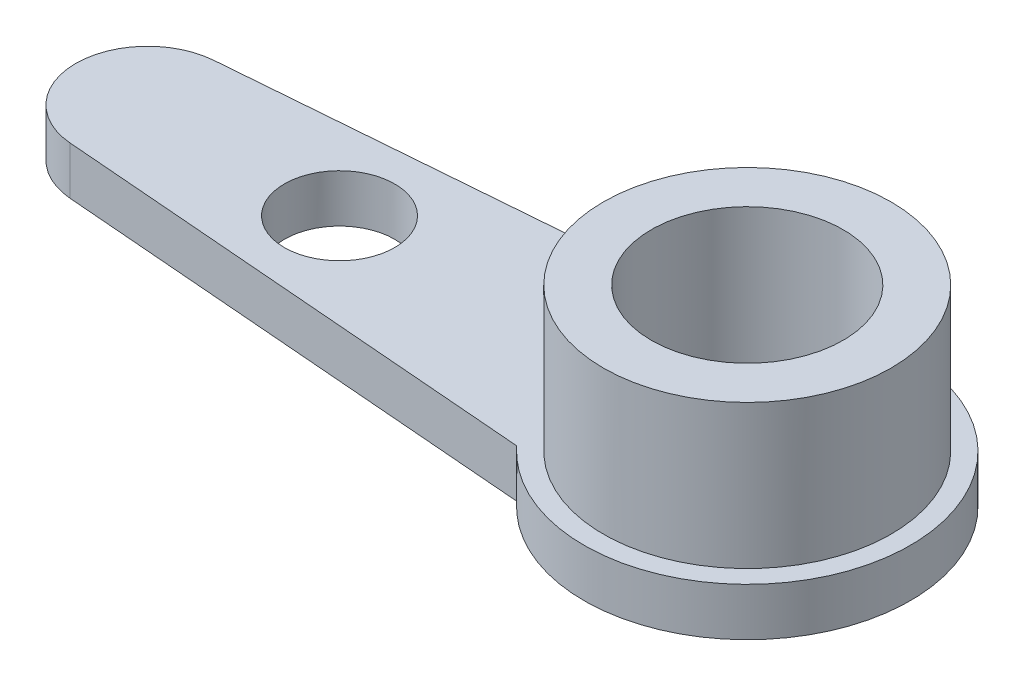
ISO-10303-21;
HEADER;
FILE_DESCRIPTION(('STEP AP214'),'2;1');
FILE_NAME('part.step','',(''),(''),'','','');
FILE_SCHEMA(('AUTOMOTIVE_DESIGN { 1 0 10303 214 1 1 1 1 }'));
ENDSEC;
DATA;
#1=APPLICATION_CONTEXT('core data for automotive mechanical design processes');
#2=APPLICATION_PROTOCOL_DEFINITION('international standard','automotive_design',2000,#1);
#3=PRODUCT_CONTEXT('',#1,'mechanical');
#4=PRODUCT('Part','Part','',(#3));
#5=PRODUCT_RELATED_PRODUCT_CATEGORY('part','',(#4));
#6=PRODUCT_DEFINITION_FORMATION('','',#4);
#7=PRODUCT_DEFINITION_CONTEXT('part definition',#1,'design');
#8=PRODUCT_DEFINITION('design','',#6,#7);
#9=PRODUCT_DEFINITION_SHAPE('','',#8);
#10=(LENGTH_UNIT() NAMED_UNIT(*) SI_UNIT(.MILLI.,.METRE.));
#11=(NAMED_UNIT(*) PLANE_ANGLE_UNIT() SI_UNIT($,.RADIAN.));
#12=(NAMED_UNIT(*) SI_UNIT($,.STERADIAN.) SOLID_ANGLE_UNIT());
#13=UNCERTAINTY_MEASURE_WITH_UNIT(LENGTH_MEASURE(1.E-05),#10,'distance_accuracy_value','');
#14=(GEOMETRIC_REPRESENTATION_CONTEXT(3) GLOBAL_UNCERTAINTY_ASSIGNED_CONTEXT((#13)) GLOBAL_UNIT_ASSIGNED_CONTEXT((#10,
#11,#12)) REPRESENTATION_CONTEXT('',''));
#15=CARTESIAN_POINT('',(0.,0.,0.));
#16=DIRECTION('',(0.,0.,1.));
#17=DIRECTION('',(1.,0.,0.));
#18=AXIS2_PLACEMENT_3D('',#15,#16,#17);
#19=CARTESIAN_POINT('',(12.5,1.,0.));
#20=DIRECTION('',(0.,-1.,0.));
#21=DIRECTION('',(0.,0.,-1.));
#22=AXIS2_PLACEMENT_3D('',#19,#20,#21);
#23=PLANE('',#22);
#24=DIRECTION('',(0.996794863550169,0.,0.08));
#25=VECTOR('',#24,1.);
#26=CARTESIAN_POINT('',(-12.62,1.,1.49519229532525));
#27=LINE('',#26,#25);
#28=CARTESIAN_POINT('',(-12.62,1.,1.49519229532525));
#29=VERTEX_POINT('',#28);
#30=CARTESIAN_POINT('',(-2.5,1.,2.30739551747724));
#31=VERTEX_POINT('',#30);
#32=EDGE_CURVE('E93',#29,#31,#27,.T.);
#33=ORIENTED_EDGE('',*,*,#32,.T.);
#34=CARTESIAN_POINT('',(0.,0.999999999999999,0.));
#35=DIRECTION('',(0.,-1.,0.));
#36=DIRECTION('',(0.,0.,-1.));
#37=AXIS2_PLACEMENT_3D('',#34,#35,#36);
#38=CIRCLE('',#37,3.40206908719886);
#39=CARTESIAN_POINT('',(-2.5,0.999999999999999,-2.30739551747724));
#40=VERTEX_POINT('',#39);
#41=EDGE_CURVE('E53',#31,#40,#38,.F.);
#42=ORIENTED_EDGE('',*,*,#41,.T.);
#43=DIRECTION('',(-0.996794863550169,0.,0.08));
#44=VECTOR('',#43,1.);
#45=CARTESIAN_POINT('',(-12.62,1.,-1.49519229532525));
#46=LINE('',#45,#44);
#47=CARTESIAN_POINT('',(-12.62,1.,-1.49519229532525));
#48=VERTEX_POINT('',#47);
#49=EDGE_CURVE('E78',#40,#48,#46,.T.);
#50=ORIENTED_EDGE('',*,*,#49,.T.);
#51=CARTESIAN_POINT('',(-12.5,1.,0.));
#52=DIRECTION('',(0.,1.,0.));
#53=DIRECTION('',(0.,0.,1.));
#54=AXIS2_PLACEMENT_3D('',#51,#52,#53);
#55=CIRCLE('',#54,1.5);
#56=EDGE_CURVE('E81',#48,#29,#55,.T.);
#57=ORIENTED_EDGE('',*,*,#56,.T.);
#58=EDGE_LOOP('',(#33,#42,#50,#57));
#59=FACE_BOUND('',#58,.T.);
#60=CARTESIAN_POINT('',(-8.5,1.,0.));
#61=DIRECTION('',(0.,1.,0.));
#62=DIRECTION('',(0.,0.,1.));
#63=AXIS2_PLACEMENT_3D('',#60,#61,#62);
#64=CIRCLE('',#63,1.15);
#65=CARTESIAN_POINT('',(-8.5,1.,1.15));
#66=VERTEX_POINT('',#65);
#67=EDGE_CURVE('E109',#66,#66,#64,.T.);
#68=ORIENTED_EDGE('',*,*,#67,.F.);
#69=EDGE_LOOP('',(#68));
#70=FACE_BOUND('',#69,.T.);
#71=CARTESIAN_POINT('',(0.,1.,0.));
#72=DIRECTION('',(0.,-1.,0.));
#73=DIRECTION('',(0.,0.,-1.));
#74=AXIS2_PLACEMENT_3D('',#71,#72,#73);
#75=CIRCLE('',#74,3.);
#76=CARTESIAN_POINT('',(0.,1.,-3.));
#77=VERTEX_POINT('',#76);
#78=EDGE_CURVE('E11',#77,#77,#75,.F.);
#79=ORIENTED_EDGE('',*,*,#78,.F.);
#80=EDGE_LOOP('',(#79));
#81=FACE_BOUND('',#80,.T.);
#82=ADVANCED_FACE('F36',(#59,#70,#81),#23,.F.);
#83=CARTESIAN_POINT('',(12.5,0.,0.));
#84=DIRECTION('',(0.,-1.,0.));
#85=DIRECTION('',(0.,0.,-1.));
#86=AXIS2_PLACEMENT_3D('',#83,#84,#85);
#87=PLANE('',#86);
#88=CARTESIAN_POINT('',(0.,0.,0.));
#89=DIRECTION('',(0.,1.,0.));
#90=DIRECTION('',(0.,0.,-1.));
#91=AXIS2_PLACEMENT_3D('',#88,#89,#90);
#92=CIRCLE('',#91,3.40206908719886);
#93=CARTESIAN_POINT('',(-2.5,0.,2.30739551747724));
#94=VERTEX_POINT('',#93);
#95=CARTESIAN_POINT('',(-2.5,0.,-2.30739551747724));
#96=VERTEX_POINT('',#95);
#97=EDGE_CURVE('E125',#94,#96,#92,.T.);
#98=ORIENTED_EDGE('',*,*,#97,.F.);
#99=DIRECTION('',(0.996794863550169,0.,0.08));
#100=VECTOR('',#99,1.);
#101=CARTESIAN_POINT('',(-12.62,0.,1.49519229532525));
#102=LINE('',#101,#100);
#103=CARTESIAN_POINT('',(-12.62,0.,1.49519229532525));
#104=VERTEX_POINT('',#103);
#105=EDGE_CURVE('E83',#104,#94,#102,.T.);
#106=ORIENTED_EDGE('',*,*,#105,.F.);
#107=CARTESIAN_POINT('',(-12.5,0.,0.));
#108=DIRECTION('',(0.,1.,0.));
#109=DIRECTION('',(0.,0.,1.));
#110=AXIS2_PLACEMENT_3D('',#107,#108,#109);
#111=CIRCLE('',#110,1.5);
#112=CARTESIAN_POINT('',(-12.62,0.,-1.49519229532525));
#113=VERTEX_POINT('',#112);
#114=EDGE_CURVE('E100',#113,#104,#111,.T.);
#115=ORIENTED_EDGE('',*,*,#114,.F.);
#116=DIRECTION('',(-0.996794863550169,0.,0.08));
#117=VECTOR('',#116,1.);
#118=CARTESIAN_POINT('',(-12.62,0.,-1.49519229532525));
#119=LINE('',#118,#117);
#120=EDGE_CURVE('E66',#96,#113,#119,.T.);
#121=ORIENTED_EDGE('',*,*,#120,.F.);
#122=EDGE_LOOP('',(#98,#106,#115,#121));
#123=FACE_BOUND('',#122,.T.);
#124=CARTESIAN_POINT('',(-8.5,0.,0.));
#125=DIRECTION('',(0.,-1.,0.));
#126=DIRECTION('',(0.,0.,-1.));
#127=AXIS2_PLACEMENT_3D('',#124,#125,#126);
#128=CIRCLE('',#127,1.15);
#129=CARTESIAN_POINT('',(-8.5,0.,-1.15));
#130=VERTEX_POINT('',#129);
#131=EDGE_CURVE('E107',#130,#130,#128,.T.);
#132=ORIENTED_EDGE('',*,*,#131,.F.);
#133=EDGE_LOOP('',(#132));
#134=FACE_BOUND('',#133,.T.);
#135=CARTESIAN_POINT('',(0.,0.,0.));
#136=DIRECTION('',(0.,1.,0.));
#137=DIRECTION('',(0.,0.,1.));
#138=AXIS2_PLACEMENT_3D('',#135,#136,#137);
#139=CIRCLE('',#138,2.);
#140=CARTESIAN_POINT('',(0.,0.,2.));
#141=VERTEX_POINT('',#140);
#142=EDGE_CURVE('E101',#141,#141,#139,.T.);
#143=ORIENTED_EDGE('',*,*,#142,.T.);
#144=EDGE_LOOP('',(#143));
#145=FACE_BOUND('',#144,.T.);
#146=ADVANCED_FACE('F131',(#123,#134,#145),#87,.T.);
#147=CARTESIAN_POINT('',(-12.62,1.,-1.49519229532525));
#148=DIRECTION('',(0.08,0.,0.996794863550169));
#149=DIRECTION('',(0.996794863550169,0.,-0.08));
#150=AXIS2_PLACEMENT_3D('',#147,#148,#149);
#151=PLANE('',#150);
#152=ORIENTED_EDGE('',*,*,#120,.T.);
#153=DIRECTION('',(0.,-1.,0.));
#154=VECTOR('',#153,1.);
#155=CARTESIAN_POINT('',(-12.62,1.,-1.49519229532525));
#156=LINE('',#155,#154);
#157=EDGE_CURVE('E85',#48,#113,#156,.T.);
#158=ORIENTED_EDGE('',*,*,#157,.F.);
#159=ORIENTED_EDGE('',*,*,#49,.F.);
#160=DIRECTION('',(0.,-1.,0.));
#161=VECTOR('',#160,1.);
#162=CARTESIAN_POINT('',(-2.5,1.,-2.30739551747724));
#163=LINE('',#162,#161);
#164=EDGE_CURVE('E45',#40,#96,#163,.T.);
#165=ORIENTED_EDGE('',*,*,#164,.T.);
#166=EDGE_LOOP('',(#152,#158,#159,#165));
#167=FACE_BOUND('',#166,.T.);
#168=ADVANCED_FACE('F38',(#167),#151,.F.);
#169=CARTESIAN_POINT('',(-12.5,1.,0.));
#170=DIRECTION('',(0.,-1.,0.));
#171=DIRECTION('',(0.,0.,-1.));
#172=AXIS2_PLACEMENT_3D('',#169,#170,#171);
#173=CYLINDRICAL_SURFACE('',#172,1.5);
#174=ORIENTED_EDGE('',*,*,#114,.T.);
#175=DIRECTION('',(0.,-1.,0.));
#176=VECTOR('',#175,1.);
#177=CARTESIAN_POINT('',(-12.62,1.,1.49519229532525));
#178=LINE('',#177,#176);
#179=EDGE_CURVE('E88',#29,#104,#178,.T.);
#180=ORIENTED_EDGE('',*,*,#179,.F.);
#181=ORIENTED_EDGE('',*,*,#56,.F.);
#182=ORIENTED_EDGE('',*,*,#157,.T.);
#183=EDGE_LOOP('',(#174,#180,#181,#182));
#184=FACE_BOUND('',#183,.T.);
#185=ADVANCED_FACE('F90',(#184),#173,.T.);
#186=CARTESIAN_POINT('',(-12.62,1.,1.49519229532525));
#187=DIRECTION('',(0.08,0.,-0.996794863550169));
#188=DIRECTION('',(-0.996794863550169,0.,-0.08));
#189=AXIS2_PLACEMENT_3D('',#186,#187,#188);
#190=PLANE('',#189);
#191=ORIENTED_EDGE('',*,*,#105,.T.);
#192=DIRECTION('',(0.,-1.,0.));
#193=VECTOR('',#192,1.);
#194=CARTESIAN_POINT('',(-2.5,1.,2.30739551747724));
#195=LINE('',#194,#193);
#196=EDGE_CURVE('E95',#31,#94,#195,.T.);
#197=ORIENTED_EDGE('',*,*,#196,.F.);
#198=ORIENTED_EDGE('',*,*,#32,.F.);
#199=ORIENTED_EDGE('',*,*,#179,.T.);
#200=EDGE_LOOP('',(#191,#197,#198,#199));
#201=FACE_BOUND('',#200,.T.);
#202=ADVANCED_FACE('F134',(#201),#190,.F.);
#203=CARTESIAN_POINT('',(0.,1.,0.));
#204=DIRECTION('',(0.,-1.,0.));
#205=DIRECTION('',(0.,0.,-1.));
#206=AXIS2_PLACEMENT_3D('',#203,#204,#205);
#207=CYLINDRICAL_SURFACE('',#206,2.);
#208=ORIENTED_EDGE('',*,*,#142,.F.);
#209=EDGE_LOOP('',(#208));
#210=FACE_BOUND('',#209,.T.);
#211=CARTESIAN_POINT('',(0.,4.,0.));
#212=DIRECTION('',(0.,1.,0.));
#213=DIRECTION('',(0.,0.,1.));
#214=AXIS2_PLACEMENT_3D('',#211,#212,#213);
#215=CIRCLE('',#214,2.);
#216=CARTESIAN_POINT('',(0.,4.,2.));
#217=VERTEX_POINT('',#216);
#218=EDGE_CURVE('E119',#217,#217,#215,.T.);
#219=ORIENTED_EDGE('',*,*,#218,.T.);
#220=EDGE_LOOP('',(#219));
#221=FACE_BOUND('',#220,.T.);
#222=ADVANCED_FACE('F136',(#210,#221),#207,.F.);
#223=CARTESIAN_POINT('',(-8.5,-1.,0.));
#224=DIRECTION('',(0.,1.,0.));
#225=DIRECTION('',(0.,0.,1.));
#226=AXIS2_PLACEMENT_3D('',#223,#224,#225);
#227=CYLINDRICAL_SURFACE('',#226,1.15);
#228=ORIENTED_EDGE('',*,*,#131,.T.);
#229=EDGE_LOOP('',(#228));
#230=FACE_BOUND('',#229,.T.);
#231=ORIENTED_EDGE('',*,*,#67,.T.);
#232=EDGE_LOOP('',(#231));
#233=FACE_BOUND('',#232,.T.);
#234=ADVANCED_FACE('F143',(#230,#233),#227,.F.);
#235=CARTESIAN_POINT('',(0.,4.,0.));
#236=DIRECTION('',(0.,1.,0.));
#237=DIRECTION('',(0.,0.,1.));
#238=AXIS2_PLACEMENT_3D('',#235,#236,#237);
#239=PLANE('',#238);
#240=CARTESIAN_POINT('',(0.,4.,0.));
#241=DIRECTION('',(0.,1.,0.));
#242=DIRECTION('',(0.,0.,1.));
#243=AXIS2_PLACEMENT_3D('',#240,#241,#242);
#244=CIRCLE('',#243,3.);
#245=CARTESIAN_POINT('',(0.,4.,3.));
#246=VERTEX_POINT('',#245);
#247=EDGE_CURVE('E114',#246,#246,#244,.T.);
#248=ORIENTED_EDGE('',*,*,#247,.T.);
#249=EDGE_LOOP('',(#248));
#250=FACE_BOUND('',#249,.T.);
#251=ORIENTED_EDGE('',*,*,#218,.F.);
#252=EDGE_LOOP('',(#251));
#253=FACE_BOUND('',#252,.T.);
#254=ADVANCED_FACE('F157',(#250,#253),#239,.T.);
#255=CARTESIAN_POINT('',(0.,4.,0.));
#256=DIRECTION('',(0.,-1.,0.));
#257=DIRECTION('',(0.,0.,-1.));
#258=AXIS2_PLACEMENT_3D('',#255,#256,#257);
#259=CYLINDRICAL_SURFACE('',#258,3.);
#260=ORIENTED_EDGE('',*,*,#247,.F.);
#261=EDGE_LOOP('',(#260));
#262=FACE_BOUND('',#261,.T.);
#263=ORIENTED_EDGE('',*,*,#78,.T.);
#264=EDGE_LOOP('',(#263));
#265=FACE_BOUND('',#264,.T.);
#266=ADVANCED_FACE('F158',(#262,#265),#259,.T.);
#267=CARTESIAN_POINT('',(0.,10.,0.));
#268=DIRECTION('',(0.,-1.,0.));
#269=DIRECTION('',(0.,0.,-1.));
#270=AXIS2_PLACEMENT_3D('',#267,#268,#269);
#271=CYLINDRICAL_SURFACE('',#270,3.40206908719886);
#272=ORIENTED_EDGE('',*,*,#196,.T.);
#273=ORIENTED_EDGE('',*,*,#97,.T.);
#274=ORIENTED_EDGE('',*,*,#164,.F.);
#275=ORIENTED_EDGE('',*,*,#41,.F.);
#276=EDGE_LOOP('',(#272,#273,#274,#275));
#277=FACE_BOUND('',#276,.T.);
#278=ADVANCED_FACE('F127',(#277),#271,.T.);
#279=CLOSED_SHELL('',(#82,#146,#168,#185,#202,#222,#234,#254,#266,#278));
#280=MANIFOLD_SOLID_BREP('B2',#279);
#281=ADVANCED_BREP_SHAPE_REPRESENTATION('',(#18,#280),#14);
#282=SHAPE_DEFINITION_REPRESENTATION(#9,#281);
ENDSEC;
END-ISO-10303-21;
